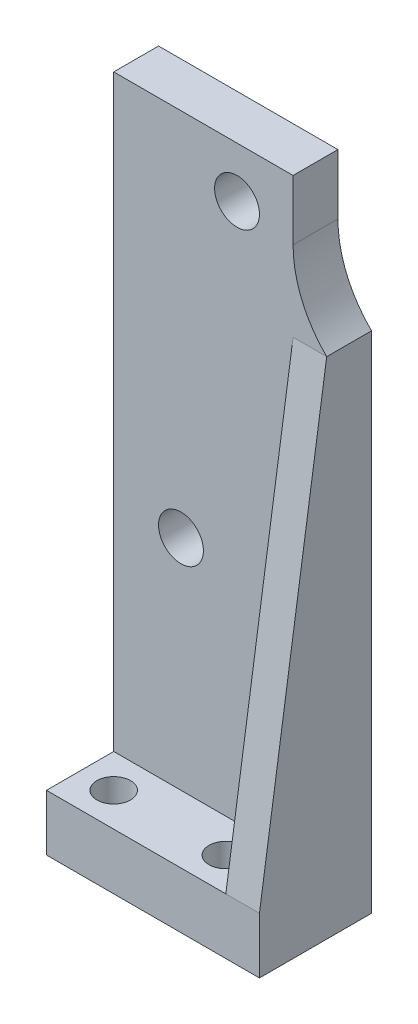
ISO-10303-21;
HEADER;
FILE_DESCRIPTION(('STEP AP214'),'2;1');
FILE_NAME('part.step','',(''),(''),'','','');
FILE_SCHEMA(('AUTOMOTIVE_DESIGN { 1 0 10303 214 1 1 1 1 }'));
ENDSEC;
DATA;
#1=APPLICATION_CONTEXT('core data for automotive mechanical design processes');
#2=APPLICATION_PROTOCOL_DEFINITION('international standard','automotive_design',2000,#1);
#3=PRODUCT_CONTEXT('',#1,'mechanical');
#4=PRODUCT('Part','Part','',(#3));
#5=PRODUCT_RELATED_PRODUCT_CATEGORY('part','',(#4));
#6=PRODUCT_DEFINITION_FORMATION('','',#4);
#7=PRODUCT_DEFINITION_CONTEXT('part definition',#1,'design');
#8=PRODUCT_DEFINITION('design','',#6,#7);
#9=PRODUCT_DEFINITION_SHAPE('','',#8);
#10=(LENGTH_UNIT() NAMED_UNIT(*) SI_UNIT(.MILLI.,.METRE.));
#11=(NAMED_UNIT(*) PLANE_ANGLE_UNIT() SI_UNIT($,.RADIAN.));
#12=(NAMED_UNIT(*) SI_UNIT($,.STERADIAN.) SOLID_ANGLE_UNIT());
#13=UNCERTAINTY_MEASURE_WITH_UNIT(LENGTH_MEASURE(1.E-05),#10,'distance_accuracy_value','');
#14=(GEOMETRIC_REPRESENTATION_CONTEXT(3) GLOBAL_UNCERTAINTY_ASSIGNED_CONTEXT((#13)) GLOBAL_UNIT_ASSIGNED_CONTEXT((#10,
#11,#12)) REPRESENTATION_CONTEXT('',''));
#15=CARTESIAN_POINT('',(0.,0.,0.));
#16=DIRECTION('',(0.,0.,1.));
#17=DIRECTION('',(1.,0.,0.));
#18=AXIS2_PLACEMENT_3D('',#15,#16,#17);
#19=CARTESIAN_POINT('',(5.,53.,3.));
#20=DIRECTION('',(0.,0.,-1.));
#21=DIRECTION('',(-1.,0.,0.));
#22=AXIS2_PLACEMENT_3D('',#19,#20,#21);
#23=CYLINDRICAL_SURFACE('',#22,2.);
#24=CARTESIAN_POINT('',(5.,53.,-3.));
#25=DIRECTION('',(0.,0.,1.));
#26=DIRECTION('',(1.,0.,0.));
#27=AXIS2_PLACEMENT_3D('',#24,#25,#26);
#28=CIRCLE('',#27,2.);
#29=CARTESIAN_POINT('',(7.,53.,-3.));
#30=VERTEX_POINT('',#29);
#31=EDGE_CURVE('E205',#30,#30,#28,.T.);
#32=ORIENTED_EDGE('',*,*,#31,.T.);
#33=EDGE_LOOP('',(#32));
#34=FACE_BOUND('',#33,.T.);
#35=CARTESIAN_POINT('',(5.,53.,-6.));
#36=DIRECTION('',(0.,0.,-1.));
#37=DIRECTION('',(-1.,0.,0.));
#38=AXIS2_PLACEMENT_3D('',#35,#36,#37);
#39=CIRCLE('',#38,2.);
#40=CARTESIAN_POINT('',(3.,53.,-6.));
#41=VERTEX_POINT('',#40);
#42=EDGE_CURVE('E148',#41,#41,#39,.F.);
#43=ORIENTED_EDGE('',*,*,#42,.F.);
#44=EDGE_LOOP('',(#43));
#45=FACE_BOUND('',#44,.T.);
#46=ADVANCED_FACE('F37',(#34,#45),#23,.F.);
#47=CARTESIAN_POINT('',(0.,5.,3.));
#48=DIRECTION('',(0.,0.,-1.));
#49=DIRECTION('',(-1.,0.,0.));
#50=AXIS2_PLACEMENT_3D('',#47,#48,#49);
#51=PLANE('',#50);
#52=DIRECTION('',(1.,0.,0.));
#53=VECTOR('',#52,1.);
#54=CARTESIAN_POINT('',(0.,0.,3.));
#55=LINE('',#54,#53);
#56=CARTESIAN_POINT('',(-6.,0.,3.));
#57=VERTEX_POINT('',#56);
#58=CARTESIAN_POINT('',(13.,0.,3.));
#59=VERTEX_POINT('',#58);
#60=EDGE_CURVE('E200',#57,#59,#55,.T.);
#61=ORIENTED_EDGE('',*,*,#60,.T.);
#62=DIRECTION('',(0.,-1.,0.));
#63=VECTOR('',#62,1.);
#64=CARTESIAN_POINT('',(13.,0.,3.));
#65=LINE('',#64,#63);
#66=CARTESIAN_POINT('',(13.,5.,3.));
#67=VERTEX_POINT('',#66);
#68=EDGE_CURVE('E134',#67,#59,#65,.T.);
#69=ORIENTED_EDGE('',*,*,#68,.F.);
#70=DIRECTION('',(-1.,0.,0.));
#71=VECTOR('',#70,1.);
#72=CARTESIAN_POINT('',(13.,5.,3.));
#73=LINE('',#72,#71);
#74=CARTESIAN_POINT('',(10.,5.,3.));
#75=VERTEX_POINT('',#74);
#76=EDGE_CURVE('E132',#67,#75,#73,.T.);
#77=ORIENTED_EDGE('',*,*,#76,.T.);
#78=DIRECTION('',(1.,0.,0.));
#79=VECTOR('',#78,1.);
#80=CARTESIAN_POINT('',(0.,5.,3.));
#81=LINE('',#80,#79);
#82=CARTESIAN_POINT('',(-6.,5.,3.));
#83=VERTEX_POINT('',#82);
#84=EDGE_CURVE('E185',#83,#75,#81,.T.);
#85=ORIENTED_EDGE('',*,*,#84,.F.);
#86=DIRECTION('',(0.,-1.,0.));
#87=VECTOR('',#86,1.);
#88=CARTESIAN_POINT('',(-6.,5.,3.));
#89=LINE('',#88,#87);
#90=EDGE_CURVE('E194',#83,#57,#89,.T.);
#91=ORIENTED_EDGE('',*,*,#90,.T.);
#92=EDGE_LOOP('',(#61,#69,#77,#85,#91));
#93=FACE_BOUND('',#92,.T.);
#94=ADVANCED_FACE('F233',(#93),#51,.F.);
#95=CARTESIAN_POINT('',(10.,5.,0.));
#96=DIRECTION('',(1.,0.,0.));
#97=DIRECTION('',(0.,0.,-1.));
#98=AXIS2_PLACEMENT_3D('',#95,#96,#97);
#99=PLANE('',#98);
#100=DIRECTION('',(0.,1.,0.));
#101=VECTOR('',#100,1.);
#102=CARTESIAN_POINT('',(10.,0.,-3.));
#103=LINE('',#102,#101);
#104=CARTESIAN_POINT('',(10.,52.1414284285429,-3.));
#105=VERTEX_POINT('',#104);
#106=CARTESIAN_POINT('',(10.,57.5,-3.));
#107=VERTEX_POINT('',#106);
#108=EDGE_CURVE('E169',#105,#107,#103,.T.);
#109=ORIENTED_EDGE('',*,*,#108,.F.);
#110=DIRECTION('',(0.,0.,-1.));
#111=VECTOR('',#110,1.);
#112=CARTESIAN_POINT('',(10.,52.1414284285429,-7.));
#113=LINE('',#112,#111);
#114=CARTESIAN_POINT('',(10.,52.1414284285429,-7.));
#115=VERTEX_POINT('',#114);
#116=EDGE_CURVE('E110',#105,#115,#113,.T.);
#117=ORIENTED_EDGE('',*,*,#116,.T.);
#118=DIRECTION('',(0.,1.,0.));
#119=VECTOR('',#118,1.);
#120=CARTESIAN_POINT('',(10.,0.,-7.));
#121=LINE('',#120,#119);
#122=CARTESIAN_POINT('',(10.,57.5,-7.));
#123=VERTEX_POINT('',#122);
#124=EDGE_CURVE('E157',#115,#123,#121,.T.);
#125=ORIENTED_EDGE('',*,*,#124,.T.);
#126=DIRECTION('',(0.,0.,1.));
#127=VECTOR('',#126,1.);
#128=CARTESIAN_POINT('',(10.,57.5,-7.));
#129=LINE('',#128,#127);
#130=EDGE_CURVE('E166',#123,#107,#129,.T.);
#131=ORIENTED_EDGE('',*,*,#130,.T.);
#132=EDGE_LOOP('',(#109,#117,#125,#131));
#133=FACE_BOUND('',#132,.T.);
#134=ADVANCED_FACE('F213',(#133),#99,.T.);
#135=CARTESIAN_POINT('',(-3.,5.,0.));
#136=DIRECTION('',(0.,-1.,0.));
#137=DIRECTION('',(0.,0.,-1.));
#138=AXIS2_PLACEMENT_3D('',#135,#136,#137);
#139=CYLINDRICAL_SURFACE('',#138,1.5);
#140=CARTESIAN_POINT('',(-3.,5.,0.));
#141=DIRECTION('',(0.,1.,0.));
#142=DIRECTION('',(0.,0.,1.));
#143=AXIS2_PLACEMENT_3D('',#140,#141,#142);
#144=CIRCLE('',#143,1.5);
#145=CARTESIAN_POINT('',(-3.,5.,1.5));
#146=VERTEX_POINT('',#145);
#147=EDGE_CURVE('E181',#146,#146,#144,.T.);
#148=ORIENTED_EDGE('',*,*,#147,.T.);
#149=EDGE_LOOP('',(#148));
#150=FACE_BOUND('',#149,.T.);
#151=CARTESIAN_POINT('',(-3.,0.,0.));
#152=DIRECTION('',(0.,1.,0.));
#153=DIRECTION('',(0.,0.,1.));
#154=AXIS2_PLACEMENT_3D('',#151,#152,#153);
#155=CIRCLE('',#154,1.5);
#156=CARTESIAN_POINT('',(-3.,0.,1.5));
#157=VERTEX_POINT('',#156);
#158=EDGE_CURVE('E197',#157,#157,#155,.T.);
#159=ORIENTED_EDGE('',*,*,#158,.F.);
#160=EDGE_LOOP('',(#159));
#161=FACE_BOUND('',#160,.T.);
#162=ADVANCED_FACE('F406',(#150,#161),#139,.F.);
#163=CARTESIAN_POINT('',(7.,5.,0.));
#164=DIRECTION('',(0.,-1.,0.));
#165=DIRECTION('',(0.,0.,-1.));
#166=AXIS2_PLACEMENT_3D('',#163,#164,#165);
#167=CYLINDRICAL_SURFACE('',#166,1.5);
#168=CARTESIAN_POINT('',(7.,5.,0.));
#169=DIRECTION('',(0.,1.,0.));
#170=DIRECTION('',(0.,0.,1.));
#171=AXIS2_PLACEMENT_3D('',#168,#169,#170);
#172=CIRCLE('',#171,1.5);
#173=CARTESIAN_POINT('',(7.,5.,1.5));
#174=VERTEX_POINT('',#173);
#175=EDGE_CURVE('E178',#174,#174,#172,.T.);
#176=ORIENTED_EDGE('',*,*,#175,.T.);
#177=EDGE_LOOP('',(#176));
#178=FACE_BOUND('',#177,.T.);
#179=CARTESIAN_POINT('',(7.,0.,0.));
#180=DIRECTION('',(0.,1.,0.));
#181=DIRECTION('',(0.,0.,1.));
#182=AXIS2_PLACEMENT_3D('',#179,#180,#181);
#183=CIRCLE('',#182,1.5);
#184=CARTESIAN_POINT('',(7.,0.,1.5));
#185=VERTEX_POINT('',#184);
#186=EDGE_CURVE('E175',#185,#185,#183,.T.);
#187=ORIENTED_EDGE('',*,*,#186,.F.);
#188=EDGE_LOOP('',(#187));
#189=FACE_BOUND('',#188,.T.);
#190=ADVANCED_FACE('F401',(#178,#189),#167,.F.);
#191=CARTESIAN_POINT('',(-6.,5.,0.));
#192=DIRECTION('',(1.,0.,0.));
#193=DIRECTION('',(0.,0.,-1.));
#194=AXIS2_PLACEMENT_3D('',#191,#192,#193);
#195=PLANE('',#194);
#196=DIRECTION('',(0.,0.,1.));
#197=VECTOR('',#196,1.);
#198=CARTESIAN_POINT('',(-6.,0.,0.));
#199=LINE('',#198,#197);
#200=CARTESIAN_POINT('',(-6.,0.,-7.));
#201=VERTEX_POINT('',#200);
#202=EDGE_CURVE('E182',#201,#57,#199,.T.);
#203=ORIENTED_EDGE('',*,*,#202,.T.);
#204=ORIENTED_EDGE('',*,*,#90,.F.);
#205=DIRECTION('',(0.,0.,1.));
#206=VECTOR('',#205,1.);
#207=CARTESIAN_POINT('',(-6.,5.,0.));
#208=LINE('',#207,#206);
#209=CARTESIAN_POINT('',(-6.,5.,-3.));
#210=VERTEX_POINT('',#209);
#211=EDGE_CURVE('E192',#210,#83,#208,.T.);
#212=ORIENTED_EDGE('',*,*,#211,.F.);
#213=DIRECTION('',(0.,-1.,0.));
#214=VECTOR('',#213,1.);
#215=CARTESIAN_POINT('',(-5.99999999999999,57.5,-3.));
#216=LINE('',#215,#214);
#217=CARTESIAN_POINT('',(-5.99999999999999,57.5,-3.));
#218=VERTEX_POINT('',#217);
#219=EDGE_CURVE('E158',#218,#210,#216,.T.);
#220=ORIENTED_EDGE('',*,*,#219,.F.);
#221=DIRECTION('',(0.,0.,1.));
#222=VECTOR('',#221,1.);
#223=CARTESIAN_POINT('',(-5.99999999999999,57.5,-7.));
#224=LINE('',#223,#222);
#225=CARTESIAN_POINT('',(-5.99999999999999,57.5,-7.));
#226=VERTEX_POINT('',#225);
#227=EDGE_CURVE('E173',#226,#218,#224,.T.);
#228=ORIENTED_EDGE('',*,*,#227,.F.);
#229=DIRECTION('',(0.,-1.,0.));
#230=VECTOR('',#229,1.);
#231=CARTESIAN_POINT('',(-5.99999999999999,57.5,-7.));
#232=LINE('',#231,#230);
#233=EDGE_CURVE('E163',#226,#201,#232,.T.);
#234=ORIENTED_EDGE('',*,*,#233,.T.);
#235=EDGE_LOOP('',(#203,#204,#212,#220,#228,#234));
#236=FACE_BOUND('',#235,.T.);
#237=ADVANCED_FACE('F224',(#236),#195,.F.);
#238=CARTESIAN_POINT('',(0.,5.,0.));
#239=DIRECTION('',(0.,1.,0.));
#240=DIRECTION('',(0.,0.,1.));
#241=AXIS2_PLACEMENT_3D('',#238,#239,#240);
#242=PLANE('',#241);
#243=ORIENTED_EDGE('',*,*,#175,.F.);
#244=EDGE_LOOP('',(#243));
#245=FACE_BOUND('',#244,.T.);
#246=ORIENTED_EDGE('',*,*,#147,.F.);
#247=EDGE_LOOP('',(#246));
#248=FACE_BOUND('',#247,.T.);
#249=ORIENTED_EDGE('',*,*,#84,.T.);
#250=DIRECTION('',(0.,0.,1.));
#251=VECTOR('',#250,1.);
#252=CARTESIAN_POINT('',(10.,5.,0.));
#253=LINE('',#252,#251);
#254=CARTESIAN_POINT('',(10.,5.,-3.));
#255=VERTEX_POINT('',#254);
#256=EDGE_CURVE('E187',#255,#75,#253,.T.);
#257=ORIENTED_EDGE('',*,*,#256,.F.);
#258=DIRECTION('',(1.,0.,0.));
#259=VECTOR('',#258,1.);
#260=CARTESIAN_POINT('',(0.,5.,-3.));
#261=LINE('',#260,#259);
#262=EDGE_CURVE('E190',#210,#255,#261,.T.);
#263=ORIENTED_EDGE('',*,*,#262,.F.);
#264=ORIENTED_EDGE('',*,*,#211,.T.);
#265=EDGE_LOOP('',(#249,#257,#263,#264));
#266=FACE_BOUND('',#265,.T.);
#267=ADVANCED_FACE('F229',(#245,#248,#266),#242,.T.);
#268=CARTESIAN_POINT('',(0.,0.,0.));
#269=DIRECTION('',(0.,1.,0.));
#270=DIRECTION('',(0.,0.,1.));
#271=AXIS2_PLACEMENT_3D('',#268,#269,#270);
#272=PLANE('',#271);
#273=ORIENTED_EDGE('',*,*,#186,.T.);
#274=EDGE_LOOP('',(#273));
#275=FACE_BOUND('',#274,.T.);
#276=ORIENTED_EDGE('',*,*,#158,.T.);
#277=EDGE_LOOP('',(#276));
#278=FACE_BOUND('',#277,.T.);
#279=ORIENTED_EDGE('',*,*,#60,.F.);
#280=ORIENTED_EDGE('',*,*,#202,.F.);
#281=DIRECTION('',(1.,0.,0.));
#282=VECTOR('',#281,1.);
#283=CARTESIAN_POINT('',(-6.,0.,-7.));
#284=LINE('',#283,#282);
#285=CARTESIAN_POINT('',(13.,0.,-7.));
#286=VERTEX_POINT('',#285);
#287=EDGE_CURVE('E155',#201,#286,#284,.T.);
#288=ORIENTED_EDGE('',*,*,#287,.T.);
#289=DIRECTION('',(0.,0.,-1.));
#290=VECTOR('',#289,1.);
#291=CARTESIAN_POINT('',(13.,0.,0.));
#292=LINE('',#291,#290);
#293=EDGE_CURVE('E136',#59,#286,#292,.T.);
#294=ORIENTED_EDGE('',*,*,#293,.F.);
#295=EDGE_LOOP('',(#279,#280,#288,#294));
#296=FACE_BOUND('',#295,.T.);
#297=ADVANCED_FACE('F237',(#275,#278,#296),#272,.F.);
#298=CARTESIAN_POINT('',(10.,57.5,-7.));
#299=DIRECTION('',(0.,1.,0.));
#300=DIRECTION('',(0.,0.,1.));
#301=AXIS2_PLACEMENT_3D('',#298,#299,#300);
#302=PLANE('',#301);
#303=DIRECTION('',(-1.,0.,0.));
#304=VECTOR('',#303,1.);
#305=CARTESIAN_POINT('',(10.,57.5,-3.));
#306=LINE('',#305,#304);
#307=EDGE_CURVE('E168',#107,#218,#306,.T.);
#308=ORIENTED_EDGE('',*,*,#307,.F.);
#309=ORIENTED_EDGE('',*,*,#130,.F.);
#310=DIRECTION('',(-1.,0.,0.));
#311=VECTOR('',#310,1.);
#312=CARTESIAN_POINT('',(10.,57.5,-7.));
#313=LINE('',#312,#311);
#314=EDGE_CURVE('E160',#123,#226,#313,.T.);
#315=ORIENTED_EDGE('',*,*,#314,.T.);
#316=ORIENTED_EDGE('',*,*,#227,.T.);
#317=EDGE_LOOP('',(#308,#309,#315,#316));
#318=FACE_BOUND('',#317,.T.);
#319=ADVANCED_FACE('F221',(#318),#302,.T.);
#320=CARTESIAN_POINT('',(0.,0.,-7.));
#321=DIRECTION('',(0.,0.,1.));
#322=DIRECTION('',(1.,0.,0.));
#323=AXIS2_PLACEMENT_3D('',#320,#321,#322);
#324=PLANE('',#323);
#325=CARTESIAN_POINT('',(5.,53.,-7.));
#326=DIRECTION('',(0.,0.,-1.));
#327=DIRECTION('',(-1.,0.,0.));
#328=AXIS2_PLACEMENT_3D('',#325,#326,#327);
#329=CIRCLE('',#328,3.5);
#330=CARTESIAN_POINT('',(1.5,53.,-7.));
#331=VERTEX_POINT('',#330);
#332=EDGE_CURVE('E144',#331,#331,#329,.T.);
#333=ORIENTED_EDGE('',*,*,#332,.F.);
#334=EDGE_LOOP('',(#333));
#335=FACE_BOUND('',#334,.T.);
#336=CARTESIAN_POINT('',(0.,24.5,-7.));
#337=DIRECTION('',(0.,0.,-1.));
#338=DIRECTION('',(-1.,0.,0.));
#339=AXIS2_PLACEMENT_3D('',#336,#337,#338);
#340=CIRCLE('',#339,2.);
#341=CARTESIAN_POINT('',(-2.,24.5,-7.));
#342=VERTEX_POINT('',#341);
#343=EDGE_CURVE('E151',#342,#342,#340,.T.);
#344=ORIENTED_EDGE('',*,*,#343,.F.);
#345=EDGE_LOOP('',(#344));
#346=FACE_BOUND('',#345,.T.);
#347=ORIENTED_EDGE('',*,*,#287,.F.);
#348=ORIENTED_EDGE('',*,*,#233,.F.);
#349=ORIENTED_EDGE('',*,*,#314,.F.);
#350=ORIENTED_EDGE('',*,*,#124,.F.);
#351=CARTESIAN_POINT('',(20.,52.1414284285429,-7.));
#352=DIRECTION('',(0.,0.,1.));
#353=DIRECTION('',(1.,0.,0.));
#354=AXIS2_PLACEMENT_3D('',#351,#352,#353);
#355=CIRCLE('',#354,10.);
#356=CARTESIAN_POINT('',(13.,45.,-7.));
#357=VERTEX_POINT('',#356);
#358=EDGE_CURVE('E46',#115,#357,#355,.T.);
#359=ORIENTED_EDGE('',*,*,#358,.T.);
#360=DIRECTION('',(0.,1.,0.));
#361=VECTOR('',#360,1.);
#362=CARTESIAN_POINT('',(13.,0.,-7.));
#363=LINE('',#362,#361);
#364=EDGE_CURVE('E128',#286,#357,#363,.T.);
#365=ORIENTED_EDGE('',*,*,#364,.F.);
#366=EDGE_LOOP('',(#347,#348,#349,#350,#359,#365));
#367=FACE_BOUND('',#366,.T.);
#368=ADVANCED_FACE('F217',(#335,#346,#367),#324,.F.);
#369=CARTESIAN_POINT('',(0.,0.,-3.));
#370=DIRECTION('',(0.,0.,1.));
#371=DIRECTION('',(1.,0.,0.));
#372=AXIS2_PLACEMENT_3D('',#369,#370,#371);
#373=PLANE('',#372);
#374=CARTESIAN_POINT('',(0.,24.5,-3.));
#375=DIRECTION('',(0.,0.,1.));
#376=DIRECTION('',(1.,0.,0.));
#377=AXIS2_PLACEMENT_3D('',#374,#375,#376);
#378=CIRCLE('',#377,2.);
#379=CARTESIAN_POINT('',(2.,24.5,-3.));
#380=VERTEX_POINT('',#379);
#381=EDGE_CURVE('E154',#380,#380,#378,.T.);
#382=ORIENTED_EDGE('',*,*,#381,.F.);
#383=EDGE_LOOP('',(#382));
#384=FACE_BOUND('',#383,.T.);
#385=ORIENTED_EDGE('',*,*,#31,.F.);
#386=EDGE_LOOP('',(#385));
#387=FACE_BOUND('',#386,.T.);
#388=ORIENTED_EDGE('',*,*,#219,.T.);
#389=ORIENTED_EDGE('',*,*,#262,.T.);
#390=CARTESIAN_POINT('',(10.,45.,-3.));
#391=VERTEX_POINT('',#390);
#392=EDGE_CURVE('E117',#255,#391,#103,.T.);
#393=ORIENTED_EDGE('',*,*,#392,.T.);
#394=DIRECTION('',(1.,0.,0.));
#395=VECTOR('',#394,1.);
#396=CARTESIAN_POINT('',(0.,45.,-3.));
#397=LINE('',#396,#395);
#398=CARTESIAN_POINT('',(12.9999999999996,45.,-3.));
#399=VERTEX_POINT('',#398);
#400=EDGE_CURVE('E11',#391,#399,#397,.T.);
#401=ORIENTED_EDGE('',*,*,#400,.T.);
#402=CARTESIAN_POINT('',(20.,52.1414284285429,-3.));
#403=DIRECTION('',(0.,0.,1.));
#404=DIRECTION('',(1.,0.,0.));
#405=AXIS2_PLACEMENT_3D('',#402,#403,#404);
#406=CIRCLE('',#405,10.);
#407=EDGE_CURVE('E52',#399,#105,#406,.F.);
#408=ORIENTED_EDGE('',*,*,#407,.T.);
#409=ORIENTED_EDGE('',*,*,#108,.T.);
#410=ORIENTED_EDGE('',*,*,#307,.T.);
#411=EDGE_LOOP('',(#388,#389,#393,#401,#408,#409,#410));
#412=FACE_BOUND('',#411,.T.);
#413=ADVANCED_FACE('F114',(#384,#387,#412),#373,.T.);
#414=CARTESIAN_POINT('',(0.,24.5,3.));
#415=DIRECTION('',(0.,0.,-1.));
#416=DIRECTION('',(-1.,0.,0.));
#417=AXIS2_PLACEMENT_3D('',#414,#415,#416);
#418=CYLINDRICAL_SURFACE('',#417,2.);
#419=ORIENTED_EDGE('',*,*,#381,.T.);
#420=EDGE_LOOP('',(#419));
#421=FACE_BOUND('',#420,.T.);
#422=ORIENTED_EDGE('',*,*,#343,.T.);
#423=EDGE_LOOP('',(#422));
#424=FACE_BOUND('',#423,.T.);
#425=ADVANCED_FACE('F260',(#421,#424),#418,.F.);
#426=CARTESIAN_POINT('',(5.,53.,-6.));
#427=DIRECTION('',(0.,0.,-1.));
#428=DIRECTION('',(-1.,0.,0.));
#429=AXIS2_PLACEMENT_3D('',#426,#427,#428);
#430=PLANE('',#429);
#431=CARTESIAN_POINT('',(5.,53.,-6.));
#432=DIRECTION('',(0.,0.,-1.));
#433=DIRECTION('',(-1.,0.,0.));
#434=AXIS2_PLACEMENT_3D('',#431,#432,#433);
#435=CIRCLE('',#434,3.5);
#436=CARTESIAN_POINT('',(1.5,53.,-6.));
#437=VERTEX_POINT('',#436);
#438=EDGE_CURVE('E145',#437,#437,#435,.T.);
#439=ORIENTED_EDGE('',*,*,#438,.T.);
#440=EDGE_LOOP('',(#439));
#441=FACE_BOUND('',#440,.T.);
#442=ORIENTED_EDGE('',*,*,#42,.T.);
#443=EDGE_LOOP('',(#442));
#444=FACE_BOUND('',#443,.T.);
#445=ADVANCED_FACE('F270',(#441,#444),#430,.T.);
#446=CARTESIAN_POINT('',(5.,53.,-6.));
#447=DIRECTION('',(0.,0.,-1.));
#448=DIRECTION('',(-1.,0.,0.));
#449=AXIS2_PLACEMENT_3D('',#446,#447,#448);
#450=CYLINDRICAL_SURFACE('',#449,3.5);
#451=ORIENTED_EDGE('',*,*,#438,.F.);
#452=EDGE_LOOP('',(#451));
#453=FACE_BOUND('',#452,.T.);
#454=ORIENTED_EDGE('',*,*,#332,.T.);
#455=EDGE_LOOP('',(#454));
#456=FACE_BOUND('',#455,.T.);
#457=ADVANCED_FACE('F281',(#453,#456),#450,.F.);
#458=CARTESIAN_POINT('',(13.,0.550122249388753,3.66748166259169));
#459=DIRECTION('',(0.,-0.148340452930245,-0.988936352868298));
#460=DIRECTION('',(0.,0.988936352868298,-0.148340452930245));
#461=AXIS2_PLACEMENT_3D('',#458,#459,#460);
#462=PLANE('',#461);
#463=DIRECTION('',(0.,-0.988936352868298,0.148340452930245));
#464=VECTOR('',#463,1.);
#465=CARTESIAN_POINT('',(10.,0.550122249388753,3.66748166259169));
#466=LINE('',#465,#464);
#467=EDGE_CURVE('E141',#391,#75,#466,.T.);
#468=ORIENTED_EDGE('',*,*,#467,.T.);
#469=ORIENTED_EDGE('',*,*,#76,.F.);
#470=DIRECTION('',(0.,-0.988936352868298,0.148340452930245));
#471=VECTOR('',#470,1.);
#472=CARTESIAN_POINT('',(13.,0.550122249388753,3.66748166259169));
#473=LINE('',#472,#471);
#474=EDGE_CURVE('E125',#399,#67,#473,.T.);
#475=ORIENTED_EDGE('',*,*,#474,.F.);
#476=ORIENTED_EDGE('',*,*,#400,.F.);
#477=EDGE_LOOP('',(#468,#469,#475,#476));
#478=FACE_BOUND('',#477,.T.);
#479=ADVANCED_FACE('F130',(#478),#462,.F.);
#480=CARTESIAN_POINT('',(13.,0.,0.));
#481=DIRECTION('',(1.,0.,0.));
#482=DIRECTION('',(0.,0.,-1.));
#483=AXIS2_PLACEMENT_3D('',#480,#481,#482);
#484=PLANE('',#483);
#485=ORIENTED_EDGE('',*,*,#364,.T.);
#486=DIRECTION('',(0.,0.,1.));
#487=VECTOR('',#486,1.);
#488=CARTESIAN_POINT('',(13.,45.,0.));
#489=LINE('',#488,#487);
#490=EDGE_CURVE('E109',#357,#399,#489,.T.);
#491=ORIENTED_EDGE('',*,*,#490,.T.);
#492=ORIENTED_EDGE('',*,*,#474,.T.);
#493=ORIENTED_EDGE('',*,*,#68,.T.);
#494=ORIENTED_EDGE('',*,*,#293,.T.);
#495=EDGE_LOOP('',(#485,#491,#492,#493,#494));
#496=FACE_BOUND('',#495,.T.);
#497=ADVANCED_FACE('F123',(#496),#484,.T.);
#498=CARTESIAN_POINT('',(10.,0.,0.));
#499=DIRECTION('',(1.,0.,0.));
#500=DIRECTION('',(0.,0.,-1.));
#501=AXIS2_PLACEMENT_3D('',#498,#499,#500);
#502=PLANE('',#501);
#503=ORIENTED_EDGE('',*,*,#392,.F.);
#504=ORIENTED_EDGE('',*,*,#256,.T.);
#505=ORIENTED_EDGE('',*,*,#467,.F.);
#506=EDGE_LOOP('',(#503,#504,#505));
#507=FACE_BOUND('',#506,.T.);
#508=ADVANCED_FACE('F231',(#507),#502,.F.);
#509=CARTESIAN_POINT('',(20.,52.1414284285429,0.));
#510=DIRECTION('',(0.,0.,1.));
#511=DIRECTION('',(1.,0.,0.));
#512=AXIS2_PLACEMENT_3D('',#509,#510,#511);
#513=CYLINDRICAL_SURFACE('',#512,10.);
#514=ORIENTED_EDGE('',*,*,#358,.F.);
#515=ORIENTED_EDGE('',*,*,#116,.F.);
#516=ORIENTED_EDGE('',*,*,#407,.F.);
#517=ORIENTED_EDGE('',*,*,#490,.F.);
#518=EDGE_LOOP('',(#514,#515,#516,#517));
#519=FACE_BOUND('',#518,.T.);
#520=ADVANCED_FACE('F39',(#519),#513,.F.);
#521=CLOSED_SHELL('',(#46,#94,#134,#162,#190,#237,#267,#297,#319,#368,#413,#425,#445,#457,#479,
#497,#508,#520));
#522=MANIFOLD_SOLID_BREP('B2',#521);
#523=ADVANCED_BREP_SHAPE_REPRESENTATION('',(#18,#522),#14);
#524=SHAPE_DEFINITION_REPRESENTATION(#9,#523);
ENDSEC;
END-ISO-10303-21;
